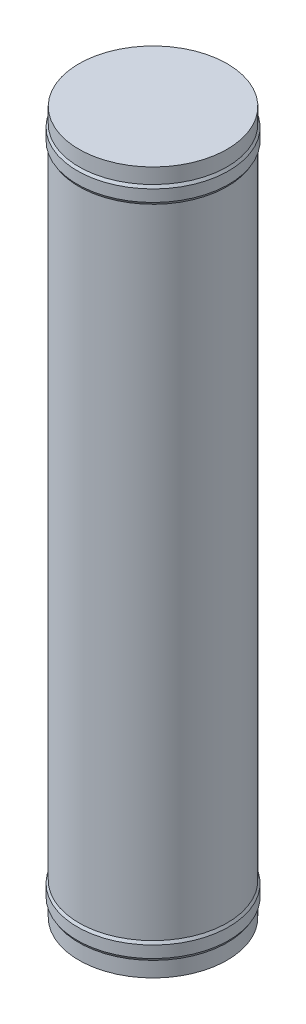
ISO-10303-21;
HEADER;
FILE_DESCRIPTION(('STEP AP214'),'2;1');
FILE_NAME('part.step','',(''),(''),'','','');
FILE_SCHEMA(('AUTOMOTIVE_DESIGN { 1 0 10303 214 1 1 1 1 }'));
ENDSEC;
DATA;
#1=APPLICATION_CONTEXT('core data for automotive mechanical design processes');
#2=APPLICATION_PROTOCOL_DEFINITION('international standard','automotive_design',2000,#1);
#3=PRODUCT_CONTEXT('',#1,'mechanical');
#4=PRODUCT('Part','Part','',(#3));
#5=PRODUCT_RELATED_PRODUCT_CATEGORY('part','',(#4));
#6=PRODUCT_DEFINITION_FORMATION('','',#4);
#7=PRODUCT_DEFINITION_CONTEXT('part definition',#1,'design');
#8=PRODUCT_DEFINITION('design','',#6,#7);
#9=PRODUCT_DEFINITION_SHAPE('','',#8);
#10=(LENGTH_UNIT() NAMED_UNIT(*) SI_UNIT(.MILLI.,.METRE.));
#11=(NAMED_UNIT(*) PLANE_ANGLE_UNIT() SI_UNIT($,.RADIAN.));
#12=(NAMED_UNIT(*) SI_UNIT($,.STERADIAN.) SOLID_ANGLE_UNIT());
#13=UNCERTAINTY_MEASURE_WITH_UNIT(LENGTH_MEASURE(1.E-05),#10,'distance_accuracy_value','');
#14=(GEOMETRIC_REPRESENTATION_CONTEXT(3) GLOBAL_UNCERTAINTY_ASSIGNED_CONTEXT((#13)) GLOBAL_UNIT_ASSIGNED_CONTEXT((#10,
#11,#12)) REPRESENTATION_CONTEXT('',''));
#15=CARTESIAN_POINT('',(0.,0.,0.));
#16=DIRECTION('',(0.,0.,1.));
#17=DIRECTION('',(1.,0.,0.));
#18=AXIS2_PLACEMENT_3D('',#15,#16,#17);
#19=CARTESIAN_POINT('',(0.,45.,0.));
#20=DIRECTION('',(0.,1.,0.));
#21=DIRECTION('',(0.,0.,1.));
#22=AXIS2_PLACEMENT_3D('',#19,#20,#21);
#23=PLANE('',#22);
#24=CARTESIAN_POINT('',(0.,45.,0.));
#25=DIRECTION('',(0.,-1.,0.));
#26=DIRECTION('',(0.,0.,-1.));
#27=AXIS2_PLACEMENT_3D('',#24,#25,#26);
#28=CIRCLE('',#27,9.49999999999999);
#29=CARTESIAN_POINT('',(0.,45.,-9.49999999999999));
#30=VERTEX_POINT('',#29);
#31=EDGE_CURVE('E10',#30,#30,#28,.T.);
#32=ORIENTED_EDGE('',*,*,#31,.F.);
#33=EDGE_LOOP('',(#32));
#34=FACE_BOUND('',#33,.T.);
#35=ADVANCED_FACE('F37',(#34),#23,.T.);
#36=CARTESIAN_POINT('',(0.,-45.,0.));
#37=DIRECTION('',(0.,-1.,0.));
#38=DIRECTION('',(0.,0.,-1.));
#39=AXIS2_PLACEMENT_3D('',#36,#37,#38);
#40=CYLINDRICAL_SURFACE('',#39,9.5);
#41=ORIENTED_EDGE('',*,*,#31,.T.);
#42=EDGE_LOOP('',(#41));
#43=FACE_BOUND('',#42,.T.);
#44=CARTESIAN_POINT('',(0.,43.05,0.));
#45=DIRECTION('',(0.,-1.,0.));
#46=DIRECTION('',(0.,0.,-1.));
#47=AXIS2_PLACEMENT_3D('',#44,#45,#46);
#48=CIRCLE('',#47,9.5);
#49=CARTESIAN_POINT('',(0.,43.05,-9.5));
#50=VERTEX_POINT('',#49);
#51=EDGE_CURVE('E44',#50,#50,#48,.T.);
#52=ORIENTED_EDGE('',*,*,#51,.F.);
#53=EDGE_LOOP('',(#52));
#54=FACE_BOUND('',#53,.T.);
#55=ADVANCED_FACE('F101',(#43,#54),#40,.T.);
#56=CARTESIAN_POINT('',(0.,42.7035898384862,0.));
#57=DIRECTION('',(0.,-1.,0.));
#58=DIRECTION('',(0.,0.,-1.));
#59=AXIS2_PLACEMENT_3D('',#56,#57,#58);
#60=CONICAL_SURFACE('',#59,9.7,0.523598775598301);
#61=ORIENTED_EDGE('',*,*,#51,.T.);
#62=EDGE_LOOP('',(#61));
#63=FACE_BOUND('',#62,.T.);
#64=CARTESIAN_POINT('',(0.,42.7035898384862,0.));
#65=DIRECTION('',(0.,-1.,0.));
#66=DIRECTION('',(0.,0.,-1.));
#67=AXIS2_PLACEMENT_3D('',#64,#65,#66);
#68=CIRCLE('',#67,9.7);
#69=CARTESIAN_POINT('',(0.,42.7035898384862,-9.7));
#70=VERTEX_POINT('',#69);
#71=EDGE_CURVE('E49',#70,#70,#68,.T.);
#72=ORIENTED_EDGE('',*,*,#71,.F.);
#73=EDGE_LOOP('',(#72));
#74=FACE_BOUND('',#73,.T.);
#75=ADVANCED_FACE('F106',(#63,#74),#60,.T.);
#76=CARTESIAN_POINT('',(0.,-45.,0.));
#77=DIRECTION('',(0.,-1.,0.));
#78=DIRECTION('',(0.,0.,-1.));
#79=AXIS2_PLACEMENT_3D('',#76,#77,#78);
#80=CYLINDRICAL_SURFACE('',#79,9.69999999999999);
#81=ORIENTED_EDGE('',*,*,#71,.T.);
#82=EDGE_LOOP('',(#81));
#83=FACE_BOUND('',#82,.T.);
#84=CARTESIAN_POINT('',(0.,41.2035898384862,0.));
#85=DIRECTION('',(0.,-1.,0.));
#86=DIRECTION('',(0.,0.,-1.));
#87=AXIS2_PLACEMENT_3D('',#84,#85,#86);
#88=CIRCLE('',#87,9.69999999999999);
#89=CARTESIAN_POINT('',(0.,41.2035898384862,-9.69999999999999));
#90=VERTEX_POINT('',#89);
#91=EDGE_CURVE('E54',#90,#90,#88,.T.);
#92=ORIENTED_EDGE('',*,*,#91,.F.);
#93=EDGE_LOOP('',(#92));
#94=FACE_BOUND('',#93,.T.);
#95=ADVANCED_FACE('F110',(#83,#94),#80,.T.);
#96=CARTESIAN_POINT('',(0.,40.8571796769725,0.));
#97=DIRECTION('',(0.,1.,0.));
#98=DIRECTION('',(0.,0.,1.));
#99=AXIS2_PLACEMENT_3D('',#96,#97,#98);
#100=CONICAL_SURFACE('',#99,9.50000000000001,0.523598775598303);
#101=ORIENTED_EDGE('',*,*,#91,.T.);
#102=EDGE_LOOP('',(#101));
#103=FACE_BOUND('',#102,.T.);
#104=CARTESIAN_POINT('',(0.,40.8571796769725,0.));
#105=DIRECTION('',(0.,-1.,0.));
#106=DIRECTION('',(0.,0.,-1.));
#107=AXIS2_PLACEMENT_3D('',#104,#105,#106);
#108=CIRCLE('',#107,9.50000000000001);
#109=CARTESIAN_POINT('',(0.,40.8571796769725,-9.50000000000001));
#110=VERTEX_POINT('',#109);
#111=EDGE_CURVE('E60',#110,#110,#108,.T.);
#112=ORIENTED_EDGE('',*,*,#111,.F.);
#113=EDGE_LOOP('',(#112));
#114=FACE_BOUND('',#113,.T.);
#115=ADVANCED_FACE('F116',(#103,#114),#100,.T.);
#116=CARTESIAN_POINT('',(0.,-45.,0.));
#117=DIRECTION('',(0.,-1.,0.));
#118=DIRECTION('',(0.,0.,-1.));
#119=AXIS2_PLACEMENT_3D('',#116,#117,#118);
#120=CYLINDRICAL_SURFACE('',#119,9.50000000000001);
#121=ORIENTED_EDGE('',*,*,#111,.T.);
#122=EDGE_LOOP('',(#121));
#123=FACE_BOUND('',#122,.T.);
#124=CARTESIAN_POINT('',(0.,-40.8571796769725,0.));
#125=DIRECTION('',(0.,-1.,0.));
#126=DIRECTION('',(0.,0.,-1.));
#127=AXIS2_PLACEMENT_3D('',#124,#125,#126);
#128=CIRCLE('',#127,9.50000000000001);
#129=CARTESIAN_POINT('',(0.,-40.8571796769725,-9.50000000000001));
#130=VERTEX_POINT('',#129);
#131=EDGE_CURVE('E64',#130,#130,#128,.T.);
#132=ORIENTED_EDGE('',*,*,#131,.F.);
#133=EDGE_LOOP('',(#132));
#134=FACE_BOUND('',#133,.T.);
#135=ADVANCED_FACE('F120',(#123,#134),#120,.T.);
#136=CARTESIAN_POINT('',(0.,-41.2035898384862,0.));
#137=DIRECTION('',(0.,-1.,0.));
#138=DIRECTION('',(0.,0.,-1.));
#139=AXIS2_PLACEMENT_3D('',#136,#137,#138);
#140=CONICAL_SURFACE('',#139,9.69999999999999,0.523598775598303);
#141=ORIENTED_EDGE('',*,*,#131,.T.);
#142=EDGE_LOOP('',(#141));
#143=FACE_BOUND('',#142,.T.);
#144=CARTESIAN_POINT('',(0.,-41.2035898384862,0.));
#145=DIRECTION('',(0.,-1.,0.));
#146=DIRECTION('',(0.,0.,-1.));
#147=AXIS2_PLACEMENT_3D('',#144,#145,#146);
#148=CIRCLE('',#147,9.69999999999999);
#149=CARTESIAN_POINT('',(0.,-41.2035898384862,-9.69999999999999));
#150=VERTEX_POINT('',#149);
#151=EDGE_CURVE('E68',#150,#150,#148,.T.);
#152=ORIENTED_EDGE('',*,*,#151,.F.);
#153=EDGE_LOOP('',(#152));
#154=FACE_BOUND('',#153,.T.);
#155=ADVANCED_FACE('F124',(#143,#154),#140,.T.);
#156=CARTESIAN_POINT('',(0.,-45.,0.));
#157=DIRECTION('',(0.,-1.,0.));
#158=DIRECTION('',(0.,0.,-1.));
#159=AXIS2_PLACEMENT_3D('',#156,#157,#158);
#160=CYLINDRICAL_SURFACE('',#159,9.69999999999999);
#161=ORIENTED_EDGE('',*,*,#151,.T.);
#162=EDGE_LOOP('',(#161));
#163=FACE_BOUND('',#162,.T.);
#164=CARTESIAN_POINT('',(0.,-42.7035898384862,0.));
#165=DIRECTION('',(0.,-1.,0.));
#166=DIRECTION('',(0.,0.,-1.));
#167=AXIS2_PLACEMENT_3D('',#164,#165,#166);
#168=CIRCLE('',#167,9.7);
#169=CARTESIAN_POINT('',(0.,-42.7035898384862,-9.7));
#170=VERTEX_POINT('',#169);
#171=EDGE_CURVE('E72',#170,#170,#168,.T.);
#172=ORIENTED_EDGE('',*,*,#171,.F.);
#173=EDGE_LOOP('',(#172));
#174=FACE_BOUND('',#173,.T.);
#175=ADVANCED_FACE('F97',(#163,#174),#160,.T.);
#176=CARTESIAN_POINT('',(0.,-43.05,0.));
#177=DIRECTION('',(0.,1.,0.));
#178=DIRECTION('',(0.,0.,1.));
#179=AXIS2_PLACEMENT_3D('',#176,#177,#178);
#180=CONICAL_SURFACE('',#179,9.5,0.523598775598292);
#181=ORIENTED_EDGE('',*,*,#171,.T.);
#182=EDGE_LOOP('',(#181));
#183=FACE_BOUND('',#182,.T.);
#184=CARTESIAN_POINT('',(0.,-43.05,0.));
#185=DIRECTION('',(0.,-1.,0.));
#186=DIRECTION('',(0.,0.,-1.));
#187=AXIS2_PLACEMENT_3D('',#184,#185,#186);
#188=CIRCLE('',#187,9.5);
#189=CARTESIAN_POINT('',(0.,-43.05,-9.5));
#190=VERTEX_POINT('',#189);
#191=EDGE_CURVE('E76',#190,#190,#188,.T.);
#192=ORIENTED_EDGE('',*,*,#191,.F.);
#193=EDGE_LOOP('',(#192));
#194=FACE_BOUND('',#193,.T.);
#195=ADVANCED_FACE('F89',(#183,#194),#180,.T.);
#196=CARTESIAN_POINT('',(0.,-45.,0.));
#197=DIRECTION('',(0.,-1.,0.));
#198=DIRECTION('',(0.,0.,-1.));
#199=AXIS2_PLACEMENT_3D('',#196,#197,#198);
#200=CYLINDRICAL_SURFACE('',#199,9.5);
#201=ORIENTED_EDGE('',*,*,#191,.T.);
#202=EDGE_LOOP('',(#201));
#203=FACE_BOUND('',#202,.T.);
#204=CARTESIAN_POINT('',(0.,-45.,0.));
#205=DIRECTION('',(0.,-1.,0.));
#206=DIRECTION('',(0.,0.,-1.));
#207=AXIS2_PLACEMENT_3D('',#204,#205,#206);
#208=CIRCLE('',#207,9.49999999999999);
#209=CARTESIAN_POINT('',(0.,-45.,-9.49999999999999));
#210=VERTEX_POINT('',#209);
#211=EDGE_CURVE('E80',#210,#210,#208,.T.);
#212=ORIENTED_EDGE('',*,*,#211,.F.);
#213=EDGE_LOOP('',(#212));
#214=FACE_BOUND('',#213,.T.);
#215=ADVANCED_FACE('F87',(#203,#214),#200,.T.);
#216=CARTESIAN_POINT('',(0.,-45.,0.));
#217=DIRECTION('',(0.,-1.,0.));
#218=DIRECTION('',(0.,0.,-1.));
#219=AXIS2_PLACEMENT_3D('',#216,#217,#218);
#220=PLANE('',#219);
#221=ORIENTED_EDGE('',*,*,#211,.T.);
#222=EDGE_LOOP('',(#221));
#223=FACE_BOUND('',#222,.T.);
#224=ADVANCED_FACE('F85',(#223),#220,.T.);
#225=CLOSED_SHELL('',(#35,#55,#75,#95,#115,#135,#155,#175,#195,#215,#224));
#226=MANIFOLD_SOLID_BREP('B2',#225);
#227=ADVANCED_BREP_SHAPE_REPRESENTATION('',(#18,#226),#14);
#228=SHAPE_DEFINITION_REPRESENTATION(#9,#227);
ENDSEC;
END-ISO-10303-21;
